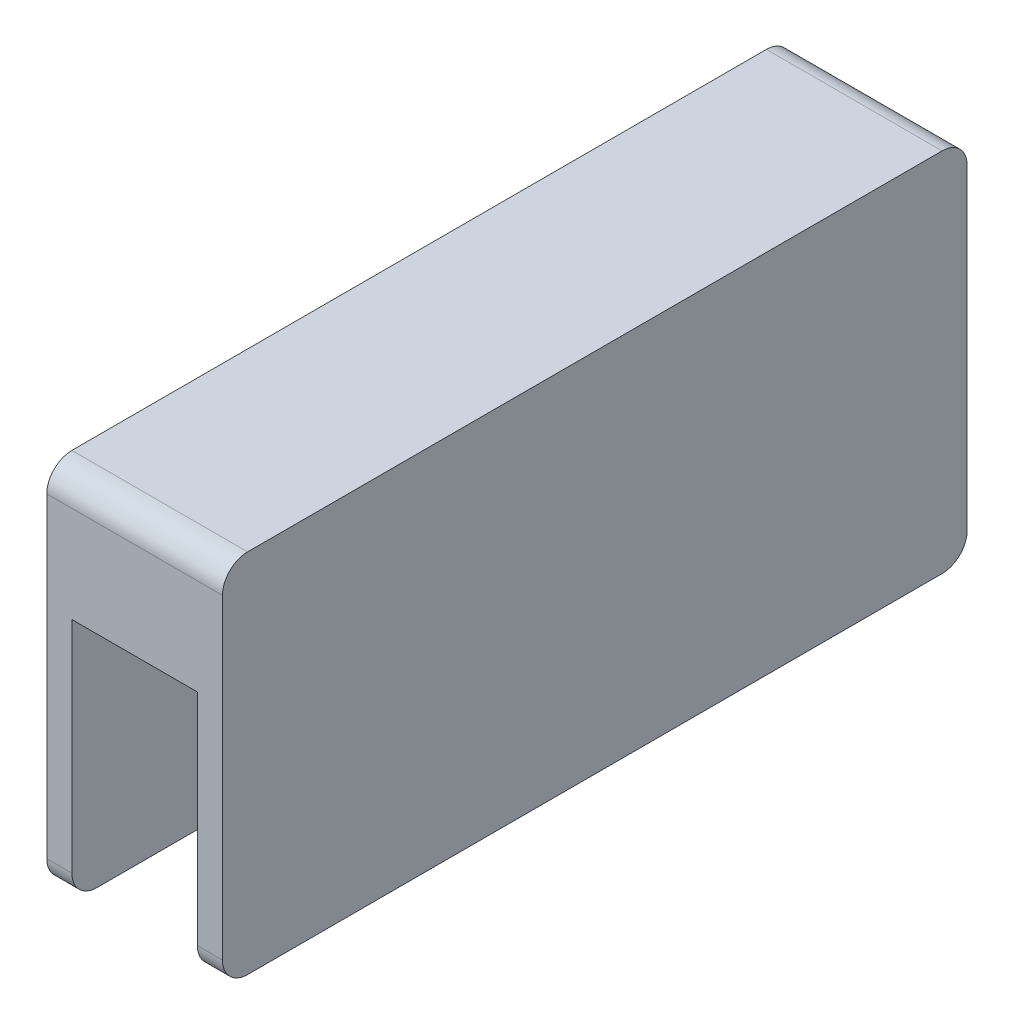
ISO-10303-21;
HEADER;
FILE_DESCRIPTION(('STEP AP214'),'2;1');
FILE_NAME('part.step','',(''),(''),'','','');
FILE_SCHEMA(('AUTOMOTIVE_DESIGN { 1 0 10303 214 1 1 1 1 }'));
ENDSEC;
DATA;
#1=APPLICATION_CONTEXT('core data for automotive mechanical design processes');
#2=APPLICATION_PROTOCOL_DEFINITION('international standard','automotive_design',2000,#1);
#3=PRODUCT_CONTEXT('',#1,'mechanical');
#4=PRODUCT('Part','Part','',(#3));
#5=PRODUCT_RELATED_PRODUCT_CATEGORY('part','',(#4));
#6=PRODUCT_DEFINITION_FORMATION('','',#4);
#7=PRODUCT_DEFINITION_CONTEXT('part definition',#1,'design');
#8=PRODUCT_DEFINITION('design','',#6,#7);
#9=PRODUCT_DEFINITION_SHAPE('','',#8);
#10=(LENGTH_UNIT() NAMED_UNIT(*) SI_UNIT(.MILLI.,.METRE.));
#11=(NAMED_UNIT(*) PLANE_ANGLE_UNIT() SI_UNIT($,.RADIAN.));
#12=(NAMED_UNIT(*) SI_UNIT($,.STERADIAN.) SOLID_ANGLE_UNIT());
#13=UNCERTAINTY_MEASURE_WITH_UNIT(LENGTH_MEASURE(1.E-05),#10,'distance_accuracy_value','');
#14=(GEOMETRIC_REPRESENTATION_CONTEXT(3) GLOBAL_UNCERTAINTY_ASSIGNED_CONTEXT((#13)) GLOBAL_UNIT_ASSIGNED_CONTEXT((#10,
#11,#12)) REPRESENTATION_CONTEXT('',''));
#15=CARTESIAN_POINT('',(0.,0.,0.));
#16=DIRECTION('',(0.,0.,1.));
#17=DIRECTION('',(1.,0.,0.));
#18=AXIS2_PLACEMENT_3D('',#15,#16,#17);
#19=CARTESIAN_POINT('',(15.,20.9769260765077,-25.4015999198652));
#20=DIRECTION('',(-1.,0.,0.));
#21=DIRECTION('',(0.,0.,1.));
#22=AXIS2_PLACEMENT_3D('',#19,#20,#21);
#23=CYLINDRICAL_SURFACE('',#22,3.);
#24=DIRECTION('',(-1.,0.,0.));
#25=VECTOR('',#24,1.);
#26=CARTESIAN_POINT('',(15.,20.9769260765077,-28.4015999198652));
#27=LINE('',#26,#25);
#28=CARTESIAN_POINT('',(18.,20.9769260765077,-28.4015999198652));
#29=VERTEX_POINT('',#28);
#30=CARTESIAN_POINT('',(-3.,20.9769260765077,-28.4015999198652));
#31=VERTEX_POINT('',#30);
#32=EDGE_CURVE('E287',#29,#31,#27,.T.);
#33=ORIENTED_EDGE('',*,*,#32,.T.);
#34=CARTESIAN_POINT('',(-3.,20.9769260765077,-25.4015999198652));
#35=DIRECTION('',(-1.,0.,0.));
#36=DIRECTION('',(0.,0.,-1.));
#37=AXIS2_PLACEMENT_3D('',#34,#35,#36);
#38=CIRCLE('',#37,3.);
#39=CARTESIAN_POINT('',(-3.,23.9769260765077,-25.4015999198652));
#40=VERTEX_POINT('',#39);
#41=EDGE_CURVE('E231',#40,#31,#38,.T.);
#42=ORIENTED_EDGE('',*,*,#41,.F.);
#43=DIRECTION('',(-1.,0.,0.));
#44=VECTOR('',#43,1.);
#45=CARTESIAN_POINT('',(15.,23.9769260765077,-25.4015999198652));
#46=LINE('',#45,#44);
#47=CARTESIAN_POINT('',(18.,23.9769260765077,-25.4015999198652));
#48=VERTEX_POINT('',#47);
#49=EDGE_CURVE('E11',#48,#40,#46,.T.);
#50=ORIENTED_EDGE('',*,*,#49,.F.);
#51=CARTESIAN_POINT('',(18.,20.9769260765077,-25.4015999198652));
#52=DIRECTION('',(1.,0.,0.));
#53=DIRECTION('',(0.,0.,1.));
#54=AXIS2_PLACEMENT_3D('',#51,#52,#53);
#55=CIRCLE('',#54,3.);
#56=EDGE_CURVE('E186',#29,#48,#55,.T.);
#57=ORIENTED_EDGE('',*,*,#56,.F.);
#58=EDGE_LOOP('',(#33,#42,#50,#57));
#59=FACE_BOUND('',#58,.T.);
#60=ADVANCED_FACE('F33',(#59),#23,.T.);
#61=CARTESIAN_POINT('',(15.,23.9769260765077,57.5984000801349));
#62=DIRECTION('',(0.,-1.,0.));
#63=DIRECTION('',(0.,0.,-1.));
#64=AXIS2_PLACEMENT_3D('',#61,#62,#63);
#65=PLANE('',#64);
#66=ORIENTED_EDGE('',*,*,#49,.T.);
#67=DIRECTION('',(0.,0.,-1.));
#68=VECTOR('',#67,1.);
#69=CARTESIAN_POINT('',(-3.,23.9769260765077,16.0984000801349));
#70=LINE('',#69,#68);
#71=CARTESIAN_POINT('',(-3.,23.9769260765077,57.5984000801349));
#72=VERTEX_POINT('',#71);
#73=EDGE_CURVE('E171',#72,#40,#70,.T.);
#74=ORIENTED_EDGE('',*,*,#73,.F.);
#75=DIRECTION('',(-1.,0.,0.));
#76=VECTOR('',#75,1.);
#77=CARTESIAN_POINT('',(15.,23.9769260765077,57.5984000801349));
#78=LINE('',#77,#76);
#79=CARTESIAN_POINT('',(18.,23.9769260765077,57.5984000801349));
#80=VERTEX_POINT('',#79);
#81=EDGE_CURVE('E41',#80,#72,#78,.T.);
#82=ORIENTED_EDGE('',*,*,#81,.F.);
#83=DIRECTION('',(0.,0.,1.));
#84=VECTOR('',#83,1.);
#85=CARTESIAN_POINT('',(18.,23.9769260765077,16.0984000801349));
#86=LINE('',#85,#84);
#87=EDGE_CURVE('E168',#48,#80,#86,.T.);
#88=ORIENTED_EDGE('',*,*,#87,.F.);
#89=EDGE_LOOP('',(#66,#74,#82,#88));
#90=FACE_BOUND('',#89,.T.);
#91=ADVANCED_FACE('F166',(#90),#65,.F.);
#92=CARTESIAN_POINT('',(15.,20.9769260765077,57.5984000801349));
#93=DIRECTION('',(-1.,0.,0.));
#94=DIRECTION('',(0.,0.,1.));
#95=AXIS2_PLACEMENT_3D('',#92,#93,#94);
#96=CYLINDRICAL_SURFACE('',#95,3.);
#97=ORIENTED_EDGE('',*,*,#81,.T.);
#98=CARTESIAN_POINT('',(-3.,20.9769260765077,57.5984000801349));
#99=DIRECTION('',(-1.,0.,0.));
#100=DIRECTION('',(0.,0.,-1.));
#101=AXIS2_PLACEMENT_3D('',#98,#99,#100);
#102=CIRCLE('',#101,3.);
#103=CARTESIAN_POINT('',(-3.,20.9769260765077,60.5984000801349));
#104=VERTEX_POINT('',#103);
#105=EDGE_CURVE('E227',#104,#72,#102,.T.);
#106=ORIENTED_EDGE('',*,*,#105,.F.);
#107=DIRECTION('',(-1.,0.,0.));
#108=VECTOR('',#107,1.);
#109=CARTESIAN_POINT('',(15.,20.9769260765077,60.5984000801349));
#110=LINE('',#109,#108);
#111=CARTESIAN_POINT('',(18.,20.9769260765077,60.5984000801349));
#112=VERTEX_POINT('',#111);
#113=EDGE_CURVE('E175',#112,#104,#110,.T.);
#114=ORIENTED_EDGE('',*,*,#113,.F.);
#115=CARTESIAN_POINT('',(18.,20.9769260765077,57.5984000801349));
#116=DIRECTION('',(1.,0.,0.));
#117=DIRECTION('',(0.,0.,1.));
#118=AXIS2_PLACEMENT_3D('',#115,#116,#117);
#119=CIRCLE('',#118,3.);
#120=EDGE_CURVE('E177',#80,#112,#119,.T.);
#121=ORIENTED_EDGE('',*,*,#120,.F.);
#122=EDGE_LOOP('',(#97,#106,#114,#121));
#123=FACE_BOUND('',#122,.T.);
#124=ADVANCED_FACE('F178',(#123),#96,.T.);
#125=CARTESIAN_POINT('',(15.,9.47692607650769,60.5984000801349));
#126=DIRECTION('',(0.,0.,-1.));
#127=DIRECTION('',(0.,1.,0.));
#128=AXIS2_PLACEMENT_3D('',#125,#126,#127);
#129=PLANE('',#128);
#130=ORIENTED_EDGE('',*,*,#113,.T.);
#131=DIRECTION('',(0.,1.,0.));
#132=VECTOR('',#131,1.);
#133=CARTESIAN_POINT('',(-3.,15.2269260765077,60.5984000801349));
#134=LINE('',#133,#132);
#135=CARTESIAN_POINT('',(-3.,-16.7730739234923,60.5984000801349));
#136=VERTEX_POINT('',#135);
#137=EDGE_CURVE('E224',#136,#104,#134,.T.);
#138=ORIENTED_EDGE('',*,*,#137,.F.);
#139=DIRECTION('',(1.,0.,0.));
#140=VECTOR('',#139,1.);
#141=CARTESIAN_POINT('',(-3.,-16.7730739234923,60.5984000801349));
#142=LINE('',#141,#140);
#143=CARTESIAN_POINT('',(0.,-16.7730739234923,60.5984000801349));
#144=VERTEX_POINT('',#143);
#145=EDGE_CURVE('E242',#136,#144,#142,.T.);
#146=ORIENTED_EDGE('',*,*,#145,.T.);
#147=DIRECTION('',(0.,1.,0.));
#148=VECTOR('',#147,1.);
#149=CARTESIAN_POINT('',(0.,15.2269260765077,60.5984000801349));
#150=LINE('',#149,#148);
#151=CARTESIAN_POINT('',(0.,9.47692607650772,60.5984000801349));
#152=VERTEX_POINT('',#151);
#153=EDGE_CURVE('E223',#144,#152,#150,.T.);
#154=ORIENTED_EDGE('',*,*,#153,.T.);
#155=DIRECTION('',(-1.,0.,0.));
#156=VECTOR('',#155,1.);
#157=CARTESIAN_POINT('',(15.,9.47692607650769,60.5984000801349));
#158=LINE('',#157,#156);
#159=CARTESIAN_POINT('',(15.,9.47692607650769,60.5984000801349));
#160=VERTEX_POINT('',#159);
#161=EDGE_CURVE('E326',#160,#152,#158,.T.);
#162=ORIENTED_EDGE('',*,*,#161,.F.);
#163=DIRECTION('',(0.,-1.,0.));
#164=VECTOR('',#163,1.);
#165=CARTESIAN_POINT('',(15.,15.2269260765077,60.5984000801349));
#166=LINE('',#165,#164);
#167=CARTESIAN_POINT('',(15.,-16.7730739234923,60.5984000801349));
#168=VERTEX_POINT('',#167);
#169=EDGE_CURVE('E204',#160,#168,#166,.T.);
#170=ORIENTED_EDGE('',*,*,#169,.T.);
#171=DIRECTION('',(-1.,0.,0.));
#172=VECTOR('',#171,1.);
#173=CARTESIAN_POINT('',(18.,-16.7730739234923,60.5984000801349));
#174=LINE('',#173,#172);
#175=CARTESIAN_POINT('',(18.,-16.7730739234923,60.5984000801349));
#176=VERTEX_POINT('',#175);
#177=EDGE_CURVE('E220',#176,#168,#174,.T.);
#178=ORIENTED_EDGE('',*,*,#177,.F.);
#179=DIRECTION('',(0.,-1.,0.));
#180=VECTOR('',#179,1.);
#181=CARTESIAN_POINT('',(18.,20.9769260765077,60.5984000801349));
#182=LINE('',#181,#180);
#183=EDGE_CURVE('E181',#112,#176,#182,.T.);
#184=ORIENTED_EDGE('',*,*,#183,.F.);
#185=EDGE_LOOP('',(#130,#138,#146,#154,#162,#170,#178,#184));
#186=FACE_BOUND('',#185,.T.);
#187=ADVANCED_FACE('F331',(#186),#129,.F.);
#188=CARTESIAN_POINT('',(15.,9.47692607650771,57.5984000801349));
#189=DIRECTION('',(-1.,0.,0.));
#190=DIRECTION('',(0.,0.,1.));
#191=AXIS2_PLACEMENT_3D('',#188,#189,#190);
#192=CYLINDRICAL_SURFACE('',#191,2.99999999999999);
#193=CARTESIAN_POINT('',(0.,9.47692607650771,57.5984000801349));
#194=DIRECTION('',(-1.,0.,0.));
#195=DIRECTION('',(0.,0.,1.));
#196=AXIS2_PLACEMENT_3D('',#193,#194,#195);
#197=CIRCLE('',#196,2.99999999999999);
#198=CARTESIAN_POINT('',(0.,12.3387436807585,56.6984000801349));
#199=VERTEX_POINT('',#198);
#200=EDGE_CURVE('E264',#152,#199,#197,.T.);
#201=ORIENTED_EDGE('',*,*,#200,.T.);
#202=DIRECTION('',(-1.,0.,0.));
#203=VECTOR('',#202,1.);
#204=CARTESIAN_POINT('',(15.,12.3387436807585,56.6984000801349));
#205=LINE('',#204,#203);
#206=CARTESIAN_POINT('',(15.,12.3387436807585,56.6984000801349));
#207=VERTEX_POINT('',#206);
#208=EDGE_CURVE('E323',#207,#199,#205,.T.);
#209=ORIENTED_EDGE('',*,*,#208,.F.);
#210=CARTESIAN_POINT('',(15.,9.47692607650771,57.5984000801349));
#211=DIRECTION('',(-1.,0.,0.));
#212=DIRECTION('',(0.,0.,1.));
#213=AXIS2_PLACEMENT_3D('',#210,#211,#212);
#214=CIRCLE('',#213,2.99999999999999);
#215=EDGE_CURVE('E265',#160,#207,#214,.T.);
#216=ORIENTED_EDGE('',*,*,#215,.F.);
#217=ORIENTED_EDGE('',*,*,#161,.T.);
#218=EDGE_LOOP('',(#201,#209,#216,#217));
#219=FACE_BOUND('',#218,.T.);
#220=ADVANCED_FACE('F345',(#219),#192,.F.);
#221=CARTESIAN_POINT('',(15.,-0.0624659376617931,60.5984000801348));
#222=DIRECTION('',(-1.,0.,0.));
#223=DIRECTION('',(0.,0.,1.));
#224=AXIS2_PLACEMENT_3D('',#221,#222,#223);
#225=CYLINDRICAL_SURFACE('',#224,13.);
#226=CARTESIAN_POINT('',(0.,-0.0624659376617931,60.5984000801348));
#227=DIRECTION('',(-1.,0.,0.));
#228=DIRECTION('',(0.,0.,-1.));
#229=AXIS2_PLACEMENT_3D('',#226,#227,#228);
#230=CIRCLE('',#229,13.);
#231=CARTESIAN_POINT('',(0.,5.58970797538169,48.8914393277999));
#232=VERTEX_POINT('',#231);
#233=EDGE_CURVE('E290',#199,#232,#230,.T.);
#234=ORIENTED_EDGE('',*,*,#233,.T.);
#235=DIRECTION('',(-1.,0.,0.));
#236=VECTOR('',#235,1.);
#237=CARTESIAN_POINT('',(15.,5.58970797538169,48.8914393277999));
#238=LINE('',#237,#236);
#239=CARTESIAN_POINT('',(15.,5.58970797538169,48.8914393277999));
#240=VERTEX_POINT('',#239);
#241=EDGE_CURVE('E320',#240,#232,#238,.T.);
#242=ORIENTED_EDGE('',*,*,#241,.F.);
#243=CARTESIAN_POINT('',(15.,-0.0624659376617931,60.5984000801348));
#244=DIRECTION('',(-1.,0.,0.));
#245=DIRECTION('',(0.,0.,-1.));
#246=AXIS2_PLACEMENT_3D('',#243,#244,#245);
#247=CIRCLE('',#246,13.);
#248=EDGE_CURVE('E268',#207,#240,#247,.T.);
#249=ORIENTED_EDGE('',*,*,#248,.F.);
#250=ORIENTED_EDGE('',*,*,#208,.T.);
#251=EDGE_LOOP('',(#234,#242,#249,#250));
#252=FACE_BOUND('',#251,.T.);
#253=ADVANCED_FACE('F395',(#252),#225,.F.);
#254=CARTESIAN_POINT('',(15.,9.93753406233823,39.8860849029268));
#255=DIRECTION('',(-1.,0.,0.));
#256=DIRECTION('',(0.,0.,1.));
#257=AXIS2_PLACEMENT_3D('',#254,#255,#256);
#258=CYLINDRICAL_SURFACE('',#257,10.);
#259=CARTESIAN_POINT('',(0.,9.93753406233823,39.8860849029268));
#260=DIRECTION('',(1.,0.,0.));
#261=DIRECTION('',(0.,0.,-1.));
#262=AXIS2_PLACEMENT_3D('',#259,#260,#261);
#263=CIRCLE('',#262,10.);
#264=CARTESIAN_POINT('',(0.,-0.0624659376617792,39.8860849029268));
#265=VERTEX_POINT('',#264);
#266=EDGE_CURVE('E293',#232,#265,#263,.T.);
#267=ORIENTED_EDGE('',*,*,#266,.T.);
#268=DIRECTION('',(-1.,0.,0.));
#269=VECTOR('',#268,1.);
#270=CARTESIAN_POINT('',(15.,-0.0624659376617792,39.8860849029268));
#271=LINE('',#270,#269);
#272=CARTESIAN_POINT('',(15.,-0.0624659376617792,39.8860849029268));
#273=VERTEX_POINT('',#272);
#274=EDGE_CURVE('E317',#273,#265,#271,.T.);
#275=ORIENTED_EDGE('',*,*,#274,.F.);
#276=CARTESIAN_POINT('',(15.,9.93753406233823,39.8860849029268));
#277=DIRECTION('',(1.,0.,0.));
#278=DIRECTION('',(0.,0.,-1.));
#279=AXIS2_PLACEMENT_3D('',#276,#277,#278);
#280=CIRCLE('',#279,10.);
#281=EDGE_CURVE('E272',#240,#273,#280,.T.);
#282=ORIENTED_EDGE('',*,*,#281,.F.);
#283=ORIENTED_EDGE('',*,*,#241,.T.);
#284=EDGE_LOOP('',(#267,#275,#282,#283));
#285=FACE_BOUND('',#284,.T.);
#286=ADVANCED_FACE('F392',(#285),#258,.T.);
#287=CARTESIAN_POINT('',(15.,-0.0624659376617792,-7.68928474265718));
#288=DIRECTION('',(0.,1.,0.));
#289=DIRECTION('',(0.,0.,1.));
#290=AXIS2_PLACEMENT_3D('',#287,#288,#289);
#291=PLANE('',#290);
#292=DIRECTION('',(0.,0.,-1.));
#293=VECTOR('',#292,1.);
#294=CARTESIAN_POINT('',(0.,-0.0624659376617792,-7.68928474265718));
#295=LINE('',#294,#293);
#296=CARTESIAN_POINT('',(0.,-0.0624659376617775,-7.68928474265718));
#297=VERTEX_POINT('',#296);
#298=EDGE_CURVE('E296',#265,#297,#295,.T.);
#299=ORIENTED_EDGE('',*,*,#298,.T.);
#300=DIRECTION('',(-1.,0.,0.));
#301=VECTOR('',#300,1.);
#302=CARTESIAN_POINT('',(15.,-0.0624659376617775,-7.68928474265718));
#303=LINE('',#302,#301);
#304=CARTESIAN_POINT('',(15.,-0.0624659376617775,-7.68928474265718));
#305=VERTEX_POINT('',#304);
#306=EDGE_CURVE('E314',#305,#297,#303,.T.);
#307=ORIENTED_EDGE('',*,*,#306,.F.);
#308=DIRECTION('',(0.,0.,-1.));
#309=VECTOR('',#308,1.);
#310=CARTESIAN_POINT('',(15.,-0.0624659376617792,39.8860849029268));
#311=LINE('',#310,#309);
#312=EDGE_CURVE('E275',#273,#305,#311,.T.);
#313=ORIENTED_EDGE('',*,*,#312,.F.);
#314=ORIENTED_EDGE('',*,*,#274,.T.);
#315=EDGE_LOOP('',(#299,#307,#313,#314));
#316=FACE_BOUND('',#315,.T.);
#317=ADVANCED_FACE('F388',(#316),#291,.F.);
#318=CARTESIAN_POINT('',(15.,9.93753406233823,-7.68928474265718));
#319=DIRECTION('',(-1.,0.,0.));
#320=DIRECTION('',(0.,0.,1.));
#321=AXIS2_PLACEMENT_3D('',#318,#319,#320);
#322=CYLINDRICAL_SURFACE('',#321,10.);
#323=CARTESIAN_POINT('',(0.,9.93753406233823,-7.68928474265718));
#324=DIRECTION('',(1.,0.,0.));
#325=DIRECTION('',(0.,0.,1.));
#326=AXIS2_PLACEMENT_3D('',#323,#324,#325);
#327=CIRCLE('',#326,10.);
#328=CARTESIAN_POINT('',(0.,5.58970797538169,-16.6946391675302));
#329=VERTEX_POINT('',#328);
#330=EDGE_CURVE('E299',#297,#329,#327,.T.);
#331=ORIENTED_EDGE('',*,*,#330,.T.);
#332=DIRECTION('',(-1.,0.,0.));
#333=VECTOR('',#332,1.);
#334=CARTESIAN_POINT('',(15.,5.58970797538169,-16.6946391675302));
#335=LINE('',#334,#333);
#336=CARTESIAN_POINT('',(15.,5.58970797538169,-16.6946391675302));
#337=VERTEX_POINT('',#336);
#338=EDGE_CURVE('E311',#337,#329,#335,.T.);
#339=ORIENTED_EDGE('',*,*,#338,.F.);
#340=CARTESIAN_POINT('',(15.,9.93753406233823,-7.68928474265718));
#341=DIRECTION('',(1.,0.,0.));
#342=DIRECTION('',(0.,0.,1.));
#343=AXIS2_PLACEMENT_3D('',#340,#341,#342);
#344=CIRCLE('',#343,10.);
#345=EDGE_CURVE('E278',#305,#337,#344,.T.);
#346=ORIENTED_EDGE('',*,*,#345,.F.);
#347=ORIENTED_EDGE('',*,*,#306,.T.);
#348=EDGE_LOOP('',(#331,#339,#346,#347));
#349=FACE_BOUND('',#348,.T.);
#350=ADVANCED_FACE('F386',(#349),#322,.T.);
#351=CARTESIAN_POINT('',(15.,-0.0624659376617931,-28.4015999198652));
#352=DIRECTION('',(-1.,0.,0.));
#353=DIRECTION('',(0.,0.,1.));
#354=AXIS2_PLACEMENT_3D('',#351,#352,#353);
#355=CYLINDRICAL_SURFACE('',#354,13.);
#356=CARTESIAN_POINT('',(0.,-0.0624659376617931,-28.4015999198652));
#357=DIRECTION('',(-1.,0.,0.));
#358=DIRECTION('',(0.,0.,1.));
#359=AXIS2_PLACEMENT_3D('',#356,#357,#358);
#360=CIRCLE('',#359,13.);
#361=CARTESIAN_POINT('',(0.,12.3387436807586,-24.5015999198653));
#362=VERTEX_POINT('',#361);
#363=EDGE_CURVE('E302',#329,#362,#360,.T.);
#364=ORIENTED_EDGE('',*,*,#363,.T.);
#365=DIRECTION('',(-1.,0.,0.));
#366=VECTOR('',#365,1.);
#367=CARTESIAN_POINT('',(15.,12.3387436807586,-24.5015999198653));
#368=LINE('',#367,#366);
#369=CARTESIAN_POINT('',(15.,12.3387436807586,-24.5015999198653));
#370=VERTEX_POINT('',#369);
#371=EDGE_CURVE('E48',#370,#362,#368,.T.);
#372=ORIENTED_EDGE('',*,*,#371,.F.);
#373=CARTESIAN_POINT('',(15.,-0.0624659376617931,-28.4015999198652));
#374=DIRECTION('',(-1.,0.,0.));
#375=DIRECTION('',(0.,0.,1.));
#376=AXIS2_PLACEMENT_3D('',#373,#374,#375);
#377=CIRCLE('',#376,13.);
#378=EDGE_CURVE('E281',#337,#370,#377,.T.);
#379=ORIENTED_EDGE('',*,*,#378,.F.);
#380=ORIENTED_EDGE('',*,*,#338,.T.);
#381=EDGE_LOOP('',(#364,#372,#379,#380));
#382=FACE_BOUND('',#381,.T.);
#383=ADVANCED_FACE('F384',(#382),#355,.F.);
#384=CARTESIAN_POINT('',(15.,9.47692607650771,-25.4015999198653));
#385=DIRECTION('',(-1.,0.,0.));
#386=DIRECTION('',(0.,0.,1.));
#387=AXIS2_PLACEMENT_3D('',#384,#385,#386);
#388=CYLINDRICAL_SURFACE('',#387,2.99999999999999);
#389=CARTESIAN_POINT('',(0.,9.47692607650771,-25.4015999198653));
#390=DIRECTION('',(-1.,0.,0.));
#391=DIRECTION('',(0.,0.,-1.));
#392=AXIS2_PLACEMENT_3D('',#389,#390,#391);
#393=CIRCLE('',#392,2.99999999999999);
#394=CARTESIAN_POINT('',(0.,9.47692607650772,-28.4015999198652));
#395=VERTEX_POINT('',#394);
#396=EDGE_CURVE('E269',#362,#395,#393,.T.);
#397=ORIENTED_EDGE('',*,*,#396,.T.);
#398=DIRECTION('',(-1.,0.,0.));
#399=VECTOR('',#398,1.);
#400=CARTESIAN_POINT('',(15.,9.47692607650769,-28.4015999198653));
#401=LINE('',#400,#399);
#402=CARTESIAN_POINT('',(15.,9.47692607650771,-28.4015999198652));
#403=VERTEX_POINT('',#402);
#404=EDGE_CURVE('E307',#403,#395,#401,.T.);
#405=ORIENTED_EDGE('',*,*,#404,.F.);
#406=CARTESIAN_POINT('',(15.,9.47692607650771,-25.4015999198653));
#407=DIRECTION('',(-1.,0.,0.));
#408=DIRECTION('',(0.,0.,-1.));
#409=AXIS2_PLACEMENT_3D('',#406,#407,#408);
#410=CIRCLE('',#409,2.99999999999999);
#411=EDGE_CURVE('E284',#370,#403,#410,.T.);
#412=ORIENTED_EDGE('',*,*,#411,.F.);
#413=ORIENTED_EDGE('',*,*,#371,.T.);
#414=EDGE_LOOP('',(#397,#405,#412,#413));
#415=FACE_BOUND('',#414,.T.);
#416=ADVANCED_FACE('F382',(#415),#388,.F.);
#417=CARTESIAN_POINT('',(15.,9.47692607650769,-28.4015999198653));
#418=DIRECTION('',(0.,0.,1.));
#419=DIRECTION('',(0.,-1.,0.));
#420=AXIS2_PLACEMENT_3D('',#417,#418,#419);
#421=PLANE('',#420);
#422=ORIENTED_EDGE('',*,*,#404,.T.);
#423=DIRECTION('',(0.,-1.,0.));
#424=VECTOR('',#423,1.);
#425=CARTESIAN_POINT('',(0.,15.2269260765077,-28.4015999198652));
#426=LINE('',#425,#424);
#427=CARTESIAN_POINT('',(0.,-16.7730739234923,-28.4015999198653));
#428=VERTEX_POINT('',#427);
#429=EDGE_CURVE('E245',#395,#428,#426,.T.);
#430=ORIENTED_EDGE('',*,*,#429,.T.);
#431=DIRECTION('',(1.,0.,0.));
#432=VECTOR('',#431,1.);
#433=CARTESIAN_POINT('',(-3.,-16.7730739234923,-28.4015999198653));
#434=LINE('',#433,#432);
#435=CARTESIAN_POINT('',(-3.,-16.7730739234923,-28.4015999198653));
#436=VERTEX_POINT('',#435);
#437=EDGE_CURVE('E261',#436,#428,#434,.T.);
#438=ORIENTED_EDGE('',*,*,#437,.F.);
#439=DIRECTION('',(0.,-1.,0.));
#440=VECTOR('',#439,1.);
#441=CARTESIAN_POINT('',(-3.,15.2269260765077,-28.4015999198652));
#442=LINE('',#441,#440);
#443=EDGE_CURVE('E234',#31,#436,#442,.T.);
#444=ORIENTED_EDGE('',*,*,#443,.F.);
#445=ORIENTED_EDGE('',*,*,#32,.F.);
#446=DIRECTION('',(0.,1.,0.));
#447=VECTOR('',#446,1.);
#448=CARTESIAN_POINT('',(18.,15.2269260765077,-28.4015999198652));
#449=LINE('',#448,#447);
#450=CARTESIAN_POINT('',(18.,-16.7730739234923,-28.4015999198652));
#451=VERTEX_POINT('',#450);
#452=EDGE_CURVE('E200',#451,#29,#449,.T.);
#453=ORIENTED_EDGE('',*,*,#452,.F.);
#454=DIRECTION('',(-1.,0.,0.));
#455=VECTOR('',#454,1.);
#456=CARTESIAN_POINT('',(18.,-16.7730739234923,-28.4015999198652));
#457=LINE('',#456,#455);
#458=CARTESIAN_POINT('',(15.,-16.7730739234923,-28.4015999198652));
#459=VERTEX_POINT('',#458);
#460=EDGE_CURVE('E203',#451,#459,#457,.T.);
#461=ORIENTED_EDGE('',*,*,#460,.T.);
#462=DIRECTION('',(0.,1.,0.));
#463=VECTOR('',#462,1.);
#464=CARTESIAN_POINT('',(15.,15.2269260765077,-28.4015999198652));
#465=LINE('',#464,#463);
#466=EDGE_CURVE('E187',#459,#403,#465,.T.);
#467=ORIENTED_EDGE('',*,*,#466,.T.);
#468=EDGE_LOOP('',(#422,#430,#438,#444,#445,#453,#461,#467));
#469=FACE_BOUND('',#468,.T.);
#470=ADVANCED_FACE('F367',(#469),#421,.F.);
#471=CARTESIAN_POINT('',(0.,-16.7730739234923,57.5984000801349));
#472=DIRECTION('',(1.,0.,0.));
#473=DIRECTION('',(0.,0.,-1.));
#474=AXIS2_PLACEMENT_3D('',#471,#472,#473);
#475=PLANE('',#474);
#476=ORIENTED_EDGE('',*,*,#396,.F.);
#477=ORIENTED_EDGE('',*,*,#363,.F.);
#478=ORIENTED_EDGE('',*,*,#330,.F.);
#479=ORIENTED_EDGE('',*,*,#298,.F.);
#480=ORIENTED_EDGE('',*,*,#266,.F.);
#481=ORIENTED_EDGE('',*,*,#233,.F.);
#482=ORIENTED_EDGE('',*,*,#200,.F.);
#483=ORIENTED_EDGE('',*,*,#153,.F.);
#484=CARTESIAN_POINT('',(0.,-16.7730739234923,57.5984000801349));
#485=DIRECTION('',(-1.,0.,0.));
#486=DIRECTION('',(0.,0.,-1.));
#487=AXIS2_PLACEMENT_3D('',#484,#485,#486);
#488=CIRCLE('',#487,3.);
#489=CARTESIAN_POINT('',(0.,-19.7730739234923,57.5984000801349));
#490=VERTEX_POINT('',#489);
#491=EDGE_CURVE('E228',#490,#144,#488,.T.);
#492=ORIENTED_EDGE('',*,*,#491,.F.);
#493=DIRECTION('',(0.,0.,1.));
#494=VECTOR('',#493,1.);
#495=CARTESIAN_POINT('',(0.,-19.7730739234923,57.5984000801349));
#496=LINE('',#495,#494);
#497=CARTESIAN_POINT('',(0.,-19.7730739234923,-25.4015999198652));
#498=VERTEX_POINT('',#497);
#499=EDGE_CURVE('E249',#498,#490,#496,.T.);
#500=ORIENTED_EDGE('',*,*,#499,.F.);
#501=CARTESIAN_POINT('',(0.,-16.7730739234923,-25.4015999198653));
#502=DIRECTION('',(-1.,0.,0.));
#503=DIRECTION('',(0.,0.,1.));
#504=AXIS2_PLACEMENT_3D('',#501,#502,#503);
#505=CIRCLE('',#504,3.);
#506=EDGE_CURVE('E247',#428,#498,#505,.T.);
#507=ORIENTED_EDGE('',*,*,#506,.F.);
#508=ORIENTED_EDGE('',*,*,#429,.F.);
#509=EDGE_LOOP('',(#476,#477,#478,#479,#480,#481,#482,#483,#492,#500,#507,#508));
#510=FACE_BOUND('',#509,.T.);
#511=ADVANCED_FACE('F380',(#510),#475,.T.);
#512=CARTESIAN_POINT('',(-3.,-16.7730739234923,-25.4015999198653));
#513=DIRECTION('',(1.,0.,0.));
#514=DIRECTION('',(0.,0.,-1.));
#515=AXIS2_PLACEMENT_3D('',#512,#513,#514);
#516=CYLINDRICAL_SURFACE('',#515,3.);
#517=ORIENTED_EDGE('',*,*,#506,.T.);
#518=DIRECTION('',(1.,0.,0.));
#519=VECTOR('',#518,1.);
#520=CARTESIAN_POINT('',(-3.,-19.7730739234923,-25.4015999198652));
#521=LINE('',#520,#519);
#522=CARTESIAN_POINT('',(-3.,-19.7730739234923,-25.4015999198652));
#523=VERTEX_POINT('',#522);
#524=EDGE_CURVE('E258',#523,#498,#521,.T.);
#525=ORIENTED_EDGE('',*,*,#524,.F.);
#526=CARTESIAN_POINT('',(-3.,-16.7730739234923,-25.4015999198653));
#527=DIRECTION('',(-1.,0.,0.));
#528=DIRECTION('',(0.,0.,1.));
#529=AXIS2_PLACEMENT_3D('',#526,#527,#528);
#530=CIRCLE('',#529,3.);
#531=EDGE_CURVE('E236',#436,#523,#530,.T.);
#532=ORIENTED_EDGE('',*,*,#531,.F.);
#533=ORIENTED_EDGE('',*,*,#437,.T.);
#534=EDGE_LOOP('',(#517,#525,#532,#533));
#535=FACE_BOUND('',#534,.T.);
#536=ADVANCED_FACE('F376',(#535),#516,.T.);
#537=CARTESIAN_POINT('',(-3.,-19.7730739234923,57.5984000801349));
#538=DIRECTION('',(0.,1.,0.));
#539=DIRECTION('',(0.,0.,1.));
#540=AXIS2_PLACEMENT_3D('',#537,#538,#539);
#541=PLANE('',#540);
#542=ORIENTED_EDGE('',*,*,#499,.T.);
#543=DIRECTION('',(1.,0.,0.));
#544=VECTOR('',#543,1.);
#545=CARTESIAN_POINT('',(-3.,-19.7730739234923,57.5984000801349));
#546=LINE('',#545,#544);
#547=CARTESIAN_POINT('',(-3.,-19.7730739234923,57.5984000801349));
#548=VERTEX_POINT('',#547);
#549=EDGE_CURVE('E255',#548,#490,#546,.T.);
#550=ORIENTED_EDGE('',*,*,#549,.F.);
#551=DIRECTION('',(0.,0.,1.));
#552=VECTOR('',#551,1.);
#553=CARTESIAN_POINT('',(-3.,-19.7730739234923,57.5984000801349));
#554=LINE('',#553,#552);
#555=EDGE_CURVE('E238',#523,#548,#554,.T.);
#556=ORIENTED_EDGE('',*,*,#555,.F.);
#557=ORIENTED_EDGE('',*,*,#524,.T.);
#558=EDGE_LOOP('',(#542,#550,#556,#557));
#559=FACE_BOUND('',#558,.T.);
#560=ADVANCED_FACE('F379',(#559),#541,.F.);
#561=CARTESIAN_POINT('',(-3.,-16.7730739234923,57.5984000801349));
#562=DIRECTION('',(1.,0.,0.));
#563=DIRECTION('',(0.,0.,-1.));
#564=AXIS2_PLACEMENT_3D('',#561,#562,#563);
#565=CYLINDRICAL_SURFACE('',#564,3.);
#566=ORIENTED_EDGE('',*,*,#491,.T.);
#567=ORIENTED_EDGE('',*,*,#145,.F.);
#568=CARTESIAN_POINT('',(-3.,-16.7730739234923,57.5984000801349));
#569=DIRECTION('',(-1.,0.,0.));
#570=DIRECTION('',(0.,0.,-1.));
#571=AXIS2_PLACEMENT_3D('',#568,#569,#570);
#572=CIRCLE('',#571,3.);
#573=EDGE_CURVE('E240',#548,#136,#572,.T.);
#574=ORIENTED_EDGE('',*,*,#573,.F.);
#575=ORIENTED_EDGE('',*,*,#549,.T.);
#576=EDGE_LOOP('',(#566,#567,#574,#575));
#577=FACE_BOUND('',#576,.T.);
#578=ADVANCED_FACE('F340',(#577),#565,.T.);
#579=CARTESIAN_POINT('',(-3.,-16.7730739234923,57.5984000801349));
#580=DIRECTION('',(1.,0.,0.));
#581=DIRECTION('',(0.,0.,-1.));
#582=AXIS2_PLACEMENT_3D('',#579,#580,#581);
#583=PLANE('',#582);
#584=ORIENTED_EDGE('',*,*,#137,.T.);
#585=ORIENTED_EDGE('',*,*,#105,.T.);
#586=ORIENTED_EDGE('',*,*,#73,.T.);
#587=ORIENTED_EDGE('',*,*,#41,.T.);
#588=ORIENTED_EDGE('',*,*,#443,.T.);
#589=ORIENTED_EDGE('',*,*,#531,.T.);
#590=ORIENTED_EDGE('',*,*,#555,.T.);
#591=ORIENTED_EDGE('',*,*,#573,.T.);
#592=EDGE_LOOP('',(#584,#585,#586,#587,#588,#589,#590,#591));
#593=FACE_BOUND('',#592,.T.);
#594=ADVANCED_FACE('F334',(#593),#583,.F.);
#595=CARTESIAN_POINT('',(15.,20.9769260765077,57.5984000801349));
#596=DIRECTION('',(-1.,0.,0.));
#597=DIRECTION('',(0.,0.,1.));
#598=AXIS2_PLACEMENT_3D('',#595,#596,#597);
#599=PLANE('',#598);
#600=ORIENTED_EDGE('',*,*,#169,.F.);
#601=ORIENTED_EDGE('',*,*,#215,.T.);
#602=ORIENTED_EDGE('',*,*,#248,.T.);
#603=ORIENTED_EDGE('',*,*,#281,.T.);
#604=ORIENTED_EDGE('',*,*,#312,.T.);
#605=ORIENTED_EDGE('',*,*,#345,.T.);
#606=ORIENTED_EDGE('',*,*,#378,.T.);
#607=ORIENTED_EDGE('',*,*,#411,.T.);
#608=ORIENTED_EDGE('',*,*,#466,.F.);
#609=CARTESIAN_POINT('',(15.,-16.7730739234923,-25.4015999198652));
#610=DIRECTION('',(1.,0.,0.));
#611=DIRECTION('',(0.,0.,1.));
#612=AXIS2_PLACEMENT_3D('',#609,#610,#611);
#613=CIRCLE('',#612,3.);
#614=CARTESIAN_POINT('',(15.,-19.7730739234923,-25.4015999198652));
#615=VERTEX_POINT('',#614);
#616=EDGE_CURVE('E190',#615,#459,#613,.T.);
#617=ORIENTED_EDGE('',*,*,#616,.F.);
#618=DIRECTION('',(0.,0.,-1.));
#619=VECTOR('',#618,1.);
#620=CARTESIAN_POINT('',(15.,-19.7730739234923,-25.4015999198652));
#621=LINE('',#620,#619);
#622=CARTESIAN_POINT('',(15.,-19.7730739234923,57.5984000801349));
#623=VERTEX_POINT('',#622);
#624=EDGE_CURVE('E208',#623,#615,#621,.T.);
#625=ORIENTED_EDGE('',*,*,#624,.F.);
#626=CARTESIAN_POINT('',(15.,-16.7730739234923,57.5984000801349));
#627=DIRECTION('',(1.,0.,0.));
#628=DIRECTION('',(0.,0.,-1.));
#629=AXIS2_PLACEMENT_3D('',#626,#627,#628);
#630=CIRCLE('',#629,3.);
#631=EDGE_CURVE('E206',#168,#623,#630,.T.);
#632=ORIENTED_EDGE('',*,*,#631,.F.);
#633=EDGE_LOOP('',(#600,#601,#602,#603,#604,#605,#606,#607,#608,#617,#625,#632));
#634=FACE_BOUND('',#633,.T.);
#635=ADVANCED_FACE('F350',(#634),#599,.T.);
#636=CARTESIAN_POINT('',(18.,-16.7730739234923,57.5984000801349));
#637=DIRECTION('',(-1.,0.,0.));
#638=DIRECTION('',(0.,0.,1.));
#639=AXIS2_PLACEMENT_3D('',#636,#637,#638);
#640=CYLINDRICAL_SURFACE('',#639,3.);
#641=ORIENTED_EDGE('',*,*,#631,.T.);
#642=DIRECTION('',(-1.,0.,0.));
#643=VECTOR('',#642,1.);
#644=CARTESIAN_POINT('',(18.,-19.7730739234923,57.5984000801349));
#645=LINE('',#644,#643);
#646=CARTESIAN_POINT('',(18.,-19.7730739234923,57.5984000801349));
#647=VERTEX_POINT('',#646);
#648=EDGE_CURVE('E217',#647,#623,#645,.T.);
#649=ORIENTED_EDGE('',*,*,#648,.F.);
#650=CARTESIAN_POINT('',(18.,-16.7730739234923,57.5984000801349));
#651=DIRECTION('',(1.,0.,0.));
#652=DIRECTION('',(0.,0.,-1.));
#653=AXIS2_PLACEMENT_3D('',#650,#651,#652);
#654=CIRCLE('',#653,3.);
#655=EDGE_CURVE('E194',#176,#647,#654,.T.);
#656=ORIENTED_EDGE('',*,*,#655,.F.);
#657=ORIENTED_EDGE('',*,*,#177,.T.);
#658=EDGE_LOOP('',(#641,#649,#656,#657));
#659=FACE_BOUND('',#658,.T.);
#660=ADVANCED_FACE('F354',(#659),#640,.T.);
#661=CARTESIAN_POINT('',(18.,-19.7730739234923,-25.4015999198652));
#662=DIRECTION('',(0.,1.,0.));
#663=DIRECTION('',(0.,0.,1.));
#664=AXIS2_PLACEMENT_3D('',#661,#662,#663);
#665=PLANE('',#664);
#666=ORIENTED_EDGE('',*,*,#624,.T.);
#667=DIRECTION('',(-1.,0.,0.));
#668=VECTOR('',#667,1.);
#669=CARTESIAN_POINT('',(18.,-19.7730739234923,-25.4015999198652));
#670=LINE('',#669,#668);
#671=CARTESIAN_POINT('',(18.,-19.7730739234923,-25.4015999198652));
#672=VERTEX_POINT('',#671);
#673=EDGE_CURVE('E214',#672,#615,#670,.T.);
#674=ORIENTED_EDGE('',*,*,#673,.F.);
#675=DIRECTION('',(0.,0.,-1.));
#676=VECTOR('',#675,1.);
#677=CARTESIAN_POINT('',(18.,-19.7730739234923,-25.4015999198652));
#678=LINE('',#677,#676);
#679=EDGE_CURVE('E196',#647,#672,#678,.T.);
#680=ORIENTED_EDGE('',*,*,#679,.F.);
#681=ORIENTED_EDGE('',*,*,#648,.T.);
#682=EDGE_LOOP('',(#666,#674,#680,#681));
#683=FACE_BOUND('',#682,.T.);
#684=ADVANCED_FACE('F361',(#683),#665,.F.);
#685=CARTESIAN_POINT('',(18.,-16.7730739234923,-25.4015999198652));
#686=DIRECTION('',(-1.,0.,0.));
#687=DIRECTION('',(0.,0.,1.));
#688=AXIS2_PLACEMENT_3D('',#685,#686,#687);
#689=CYLINDRICAL_SURFACE('',#688,3.);
#690=ORIENTED_EDGE('',*,*,#616,.T.);
#691=ORIENTED_EDGE('',*,*,#460,.F.);
#692=CARTESIAN_POINT('',(18.,-16.7730739234923,-25.4015999198652));
#693=DIRECTION('',(1.,0.,0.));
#694=DIRECTION('',(0.,0.,1.));
#695=AXIS2_PLACEMENT_3D('',#692,#693,#694);
#696=CIRCLE('',#695,3.);
#697=EDGE_CURVE('E198',#672,#451,#696,.T.);
#698=ORIENTED_EDGE('',*,*,#697,.F.);
#699=ORIENTED_EDGE('',*,*,#673,.T.);
#700=EDGE_LOOP('',(#690,#691,#698,#699));
#701=FACE_BOUND('',#700,.T.);
#702=ADVANCED_FACE('F364',(#701),#689,.T.);
#703=CARTESIAN_POINT('',(18.,20.9769260765077,57.5984000801349));
#704=DIRECTION('',(-1.,0.,0.));
#705=DIRECTION('',(0.,0.,1.));
#706=AXIS2_PLACEMENT_3D('',#703,#704,#705);
#707=PLANE('',#706);
#708=ORIENTED_EDGE('',*,*,#87,.T.);
#709=ORIENTED_EDGE('',*,*,#120,.T.);
#710=ORIENTED_EDGE('',*,*,#183,.T.);
#711=ORIENTED_EDGE('',*,*,#655,.T.);
#712=ORIENTED_EDGE('',*,*,#679,.T.);
#713=ORIENTED_EDGE('',*,*,#697,.T.);
#714=ORIENTED_EDGE('',*,*,#452,.T.);
#715=ORIENTED_EDGE('',*,*,#56,.T.);
#716=EDGE_LOOP('',(#708,#709,#710,#711,#712,#713,#714,#715));
#717=FACE_BOUND('',#716,.T.);
#718=ADVANCED_FACE('F183',(#717),#707,.F.);
#719=CLOSED_SHELL('',(#60,#91,#124,#187,#220,#253,#286,#317,#350,#383,#416,#470,#511,#536,#560,
#578,#594,#635,#660,#684,#702,#718));
#720=MANIFOLD_SOLID_BREP('B2',#719);
#721=ADVANCED_BREP_SHAPE_REPRESENTATION('',(#18,#720),#14);
#722=SHAPE_DEFINITION_REPRESENTATION(#9,#721);
ENDSEC;
END-ISO-10303-21;
